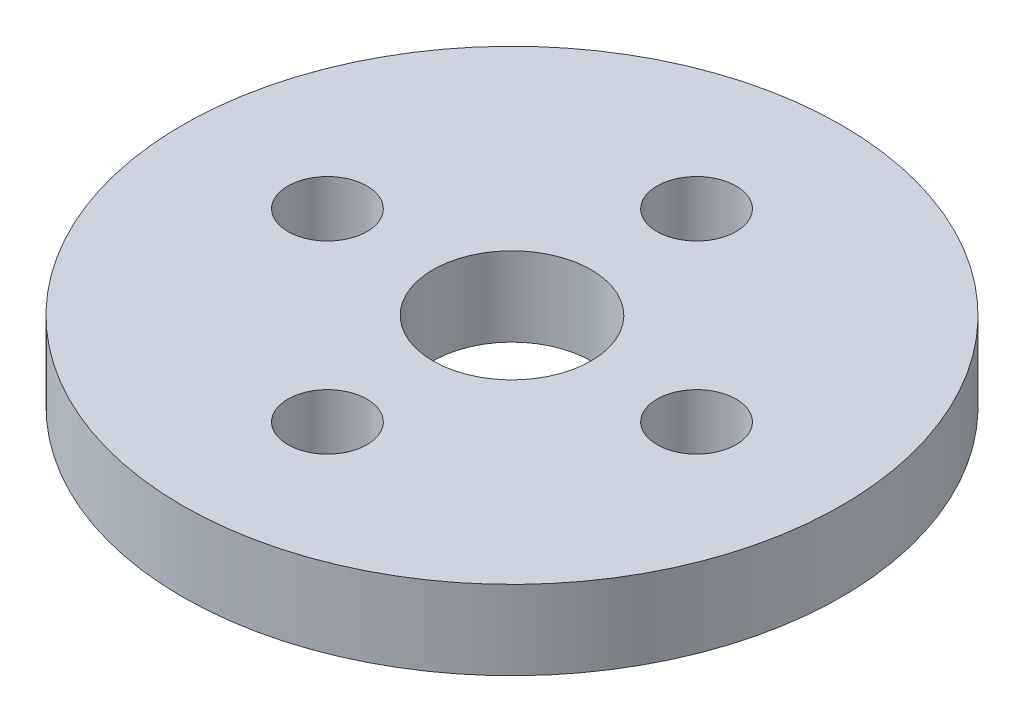
ISO-10303-21;
HEADER;
FILE_DESCRIPTION(('STEP AP214'),'2;1');
FILE_NAME('part.step','',(''),(''),'','','');
FILE_SCHEMA(('AUTOMOTIVE_DESIGN { 1 0 10303 214 1 1 1 1 }'));
ENDSEC;
DATA;
#1=APPLICATION_CONTEXT('core data for automotive mechanical design processes');
#2=APPLICATION_PROTOCOL_DEFINITION('international standard','automotive_design',2000,#1);
#3=PRODUCT_CONTEXT('',#1,'mechanical');
#4=PRODUCT('Part','Part','',(#3));
#5=PRODUCT_RELATED_PRODUCT_CATEGORY('part','',(#4));
#6=PRODUCT_DEFINITION_FORMATION('','',#4);
#7=PRODUCT_DEFINITION_CONTEXT('part definition',#1,'design');
#8=PRODUCT_DEFINITION('design','',#6,#7);
#9=PRODUCT_DEFINITION_SHAPE('','',#8);
#10=(LENGTH_UNIT() NAMED_UNIT(*) SI_UNIT(.MILLI.,.METRE.));
#11=(NAMED_UNIT(*) PLANE_ANGLE_UNIT() SI_UNIT($,.RADIAN.));
#12=(NAMED_UNIT(*) SI_UNIT($,.STERADIAN.) SOLID_ANGLE_UNIT());
#13=UNCERTAINTY_MEASURE_WITH_UNIT(LENGTH_MEASURE(1.E-05),#10,'distance_accuracy_value','');
#14=(GEOMETRIC_REPRESENTATION_CONTEXT(3) GLOBAL_UNCERTAINTY_ASSIGNED_CONTEXT((#13)) GLOBAL_UNIT_ASSIGNED_CONTEXT((#10,
#11,#12)) REPRESENTATION_CONTEXT('',''));
#15=CARTESIAN_POINT('',(0.,0.,0.));
#16=DIRECTION('',(0.,0.,1.));
#17=DIRECTION('',(1.,0.,0.));
#18=AXIS2_PLACEMENT_3D('',#15,#16,#17);
#19=CARTESIAN_POINT('',(0.,3.,0.));
#20=DIRECTION('',(0.,1.,0.));
#21=DIRECTION('',(0.,0.,1.));
#22=AXIS2_PLACEMENT_3D('',#19,#20,#21);
#23=PLANE('',#22);
#24=CARTESIAN_POINT('',(7.,3.,0.));
#25=DIRECTION('',(0.,1.,0.));
#26=DIRECTION('',(0.,0.,1.));
#27=AXIS2_PLACEMENT_3D('',#24,#25,#26);
#28=CIRCLE('',#27,1.5);
#29=CARTESIAN_POINT('',(7.,3.,1.5));
#30=VERTEX_POINT('',#29);
#31=EDGE_CURVE('E59',#30,#30,#28,.T.);
#32=ORIENTED_EDGE('',*,*,#31,.F.);
#33=EDGE_LOOP('',(#32));
#34=FACE_BOUND('',#33,.T.);
#35=CARTESIAN_POINT('',(0.,3.,0.));
#36=DIRECTION('',(0.,1.,0.));
#37=DIRECTION('',(0.,0.,1.));
#38=AXIS2_PLACEMENT_3D('',#35,#36,#37);
#39=CIRCLE('',#38,3.);
#40=CARTESIAN_POINT('',(0.,3.,3.));
#41=VERTEX_POINT('',#40);
#42=EDGE_CURVE('E47',#41,#41,#39,.T.);
#43=ORIENTED_EDGE('',*,*,#42,.F.);
#44=EDGE_LOOP('',(#43));
#45=FACE_BOUND('',#44,.T.);
#46=CARTESIAN_POINT('',(0.,3.,0.));
#47=DIRECTION('',(0.,1.,0.));
#48=DIRECTION('',(0.,0.,1.));
#49=AXIS2_PLACEMENT_3D('',#46,#47,#48);
#50=CIRCLE('',#49,12.5);
#51=CARTESIAN_POINT('',(0.,3.,12.5));
#52=VERTEX_POINT('',#51);
#53=EDGE_CURVE('E10',#52,#52,#50,.T.);
#54=ORIENTED_EDGE('',*,*,#53,.T.);
#55=EDGE_LOOP('',(#54));
#56=FACE_BOUND('',#55,.T.);
#57=CARTESIAN_POINT('',(-7.,3.,0.));
#58=DIRECTION('',(0.,1.,0.));
#59=DIRECTION('',(0.,0.,1.));
#60=AXIS2_PLACEMENT_3D('',#57,#58,#59);
#61=CIRCLE('',#60,1.5);
#62=CARTESIAN_POINT('',(-7.,3.,1.5));
#63=VERTEX_POINT('',#62);
#64=EDGE_CURVE('E42',#63,#63,#61,.T.);
#65=ORIENTED_EDGE('',*,*,#64,.F.);
#66=EDGE_LOOP('',(#65));
#67=FACE_BOUND('',#66,.T.);
#68=CARTESIAN_POINT('',(0.,3.,-7.));
#69=DIRECTION('',(0.,1.,0.));
#70=DIRECTION('',(0.,0.,1.));
#71=AXIS2_PLACEMENT_3D('',#68,#69,#70);
#72=CIRCLE('',#71,1.5);
#73=CARTESIAN_POINT('',(0.,3.,-5.5));
#74=VERTEX_POINT('',#73);
#75=EDGE_CURVE('E53',#74,#74,#72,.T.);
#76=ORIENTED_EDGE('',*,*,#75,.F.);
#77=EDGE_LOOP('',(#76));
#78=FACE_BOUND('',#77,.T.);
#79=CARTESIAN_POINT('',(0.,3.,7.));
#80=DIRECTION('',(0.,1.,0.));
#81=DIRECTION('',(0.,0.,1.));
#82=AXIS2_PLACEMENT_3D('',#79,#80,#81);
#83=CIRCLE('',#82,1.5);
#84=CARTESIAN_POINT('',(0.,3.,8.5));
#85=VERTEX_POINT('',#84);
#86=EDGE_CURVE('E65',#85,#85,#83,.T.);
#87=ORIENTED_EDGE('',*,*,#86,.F.);
#88=EDGE_LOOP('',(#87));
#89=FACE_BOUND('',#88,.T.);
#90=ADVANCED_FACE('F31',(#34,#45,#56,#67,#78,#89),#23,.T.);
#91=CARTESIAN_POINT('',(0.,0.,0.));
#92=DIRECTION('',(0.,1.,0.));
#93=DIRECTION('',(0.,0.,1.));
#94=AXIS2_PLACEMENT_3D('',#91,#92,#93);
#95=PLANE('',#94);
#96=CARTESIAN_POINT('',(0.,0.,0.));
#97=DIRECTION('',(0.,1.,0.));
#98=DIRECTION('',(0.,0.,1.));
#99=AXIS2_PLACEMENT_3D('',#96,#97,#98);
#100=CIRCLE('',#99,12.5);
#101=CARTESIAN_POINT('',(0.,0.,12.5));
#102=VERTEX_POINT('',#101);
#103=EDGE_CURVE('E35',#102,#102,#100,.T.);
#104=ORIENTED_EDGE('',*,*,#103,.F.);
#105=EDGE_LOOP('',(#104));
#106=FACE_BOUND('',#105,.T.);
#107=CARTESIAN_POINT('',(-7.,0.,0.));
#108=DIRECTION('',(0.,1.,0.));
#109=DIRECTION('',(0.,0.,1.));
#110=AXIS2_PLACEMENT_3D('',#107,#108,#109);
#111=CIRCLE('',#110,1.5);
#112=CARTESIAN_POINT('',(-7.,0.,1.5));
#113=VERTEX_POINT('',#112);
#114=EDGE_CURVE('E44',#113,#113,#111,.T.);
#115=ORIENTED_EDGE('',*,*,#114,.T.);
#116=EDGE_LOOP('',(#115));
#117=FACE_BOUND('',#116,.T.);
#118=CARTESIAN_POINT('',(0.,0.,0.));
#119=DIRECTION('',(0.,1.,0.));
#120=DIRECTION('',(0.,0.,1.));
#121=AXIS2_PLACEMENT_3D('',#118,#119,#120);
#122=CIRCLE('',#121,3.);
#123=CARTESIAN_POINT('',(0.,0.,3.));
#124=VERTEX_POINT('',#123);
#125=EDGE_CURVE('E50',#124,#124,#122,.T.);
#126=ORIENTED_EDGE('',*,*,#125,.T.);
#127=EDGE_LOOP('',(#126));
#128=FACE_BOUND('',#127,.T.);
#129=CARTESIAN_POINT('',(0.,0.,-7.));
#130=DIRECTION('',(0.,1.,0.));
#131=DIRECTION('',(0.,0.,1.));
#132=AXIS2_PLACEMENT_3D('',#129,#130,#131);
#133=CIRCLE('',#132,1.5);
#134=CARTESIAN_POINT('',(0.,0.,-5.5));
#135=VERTEX_POINT('',#134);
#136=EDGE_CURVE('E56',#135,#135,#133,.T.);
#137=ORIENTED_EDGE('',*,*,#136,.T.);
#138=EDGE_LOOP('',(#137));
#139=FACE_BOUND('',#138,.T.);
#140=CARTESIAN_POINT('',(7.,0.,0.));
#141=DIRECTION('',(0.,1.,0.));
#142=DIRECTION('',(0.,0.,1.));
#143=AXIS2_PLACEMENT_3D('',#140,#141,#142);
#144=CIRCLE('',#143,1.5);
#145=CARTESIAN_POINT('',(7.,0.,1.5));
#146=VERTEX_POINT('',#145);
#147=EDGE_CURVE('E62',#146,#146,#144,.T.);
#148=ORIENTED_EDGE('',*,*,#147,.T.);
#149=EDGE_LOOP('',(#148));
#150=FACE_BOUND('',#149,.T.);
#151=CARTESIAN_POINT('',(0.,0.,7.));
#152=DIRECTION('',(0.,1.,0.));
#153=DIRECTION('',(0.,0.,1.));
#154=AXIS2_PLACEMENT_3D('',#151,#152,#153);
#155=CIRCLE('',#154,1.5);
#156=CARTESIAN_POINT('',(0.,0.,8.5));
#157=VERTEX_POINT('',#156);
#158=EDGE_CURVE('E68',#157,#157,#155,.T.);
#159=ORIENTED_EDGE('',*,*,#158,.T.);
#160=EDGE_LOOP('',(#159));
#161=FACE_BOUND('',#160,.T.);
#162=ADVANCED_FACE('F78',(#106,#117,#128,#139,#150,#161),#95,.F.);
#163=CARTESIAN_POINT('',(0.,3.,0.));
#164=DIRECTION('',(0.,-1.,0.));
#165=DIRECTION('',(0.,0.,-1.));
#166=AXIS2_PLACEMENT_3D('',#163,#164,#165);
#167=CYLINDRICAL_SURFACE('',#166,12.5);
#168=ORIENTED_EDGE('',*,*,#53,.F.);
#169=EDGE_LOOP('',(#168));
#170=FACE_BOUND('',#169,.T.);
#171=ORIENTED_EDGE('',*,*,#103,.T.);
#172=EDGE_LOOP('',(#171));
#173=FACE_BOUND('',#172,.T.);
#174=ADVANCED_FACE('F33',(#170,#173),#167,.T.);
#175=CARTESIAN_POINT('',(-7.,3.,0.));
#176=DIRECTION('',(0.,-1.,0.));
#177=DIRECTION('',(0.,0.,-1.));
#178=AXIS2_PLACEMENT_3D('',#175,#176,#177);
#179=CYLINDRICAL_SURFACE('',#178,1.5);
#180=ORIENTED_EDGE('',*,*,#64,.T.);
#181=EDGE_LOOP('',(#180));
#182=FACE_BOUND('',#181,.T.);
#183=ORIENTED_EDGE('',*,*,#114,.F.);
#184=EDGE_LOOP('',(#183));
#185=FACE_BOUND('',#184,.T.);
#186=ADVANCED_FACE('F88',(#182,#185),#179,.F.);
#187=CARTESIAN_POINT('',(0.,3.,0.));
#188=DIRECTION('',(0.,-1.,0.));
#189=DIRECTION('',(0.,0.,-1.));
#190=AXIS2_PLACEMENT_3D('',#187,#188,#189);
#191=CYLINDRICAL_SURFACE('',#190,3.);
#192=ORIENTED_EDGE('',*,*,#42,.T.);
#193=EDGE_LOOP('',(#192));
#194=FACE_BOUND('',#193,.T.);
#195=ORIENTED_EDGE('',*,*,#125,.F.);
#196=EDGE_LOOP('',(#195));
#197=FACE_BOUND('',#196,.T.);
#198=ADVANCED_FACE('F91',(#194,#197),#191,.F.);
#199=CARTESIAN_POINT('',(0.,3.,-7.));
#200=DIRECTION('',(0.,-1.,0.));
#201=DIRECTION('',(0.,0.,-1.));
#202=AXIS2_PLACEMENT_3D('',#199,#200,#201);
#203=CYLINDRICAL_SURFACE('',#202,1.5);
#204=ORIENTED_EDGE('',*,*,#75,.T.);
#205=EDGE_LOOP('',(#204));
#206=FACE_BOUND('',#205,.T.);
#207=ORIENTED_EDGE('',*,*,#136,.F.);
#208=EDGE_LOOP('',(#207));
#209=FACE_BOUND('',#208,.T.);
#210=ADVANCED_FACE('F95',(#206,#209),#203,.F.);
#211=CARTESIAN_POINT('',(7.,3.,0.));
#212=DIRECTION('',(0.,-1.,0.));
#213=DIRECTION('',(0.,0.,-1.));
#214=AXIS2_PLACEMENT_3D('',#211,#212,#213);
#215=CYLINDRICAL_SURFACE('',#214,1.5);
#216=ORIENTED_EDGE('',*,*,#31,.T.);
#217=EDGE_LOOP('',(#216));
#218=FACE_BOUND('',#217,.T.);
#219=ORIENTED_EDGE('',*,*,#147,.F.);
#220=EDGE_LOOP('',(#219));
#221=FACE_BOUND('',#220,.T.);
#222=ADVANCED_FACE('F99',(#218,#221),#215,.F.);
#223=CARTESIAN_POINT('',(0.,3.,7.));
#224=DIRECTION('',(0.,-1.,0.));
#225=DIRECTION('',(0.,0.,-1.));
#226=AXIS2_PLACEMENT_3D('',#223,#224,#225);
#227=CYLINDRICAL_SURFACE('',#226,1.5);
#228=ORIENTED_EDGE('',*,*,#86,.T.);
#229=EDGE_LOOP('',(#228));
#230=FACE_BOUND('',#229,.T.);
#231=ORIENTED_EDGE('',*,*,#158,.F.);
#232=EDGE_LOOP('',(#231));
#233=FACE_BOUND('',#232,.T.);
#234=ADVANCED_FACE('F74',(#230,#233),#227,.F.);
#235=CLOSED_SHELL('',(#90,#162,#174,#186,#198,#210,#222,#234));
#236=MANIFOLD_SOLID_BREP('B2',#235);
#237=ADVANCED_BREP_SHAPE_REPRESENTATION('',(#18,#236),#14);
#238=SHAPE_DEFINITION_REPRESENTATION(#9,#237);
ENDSEC;
END-ISO-10303-21;
